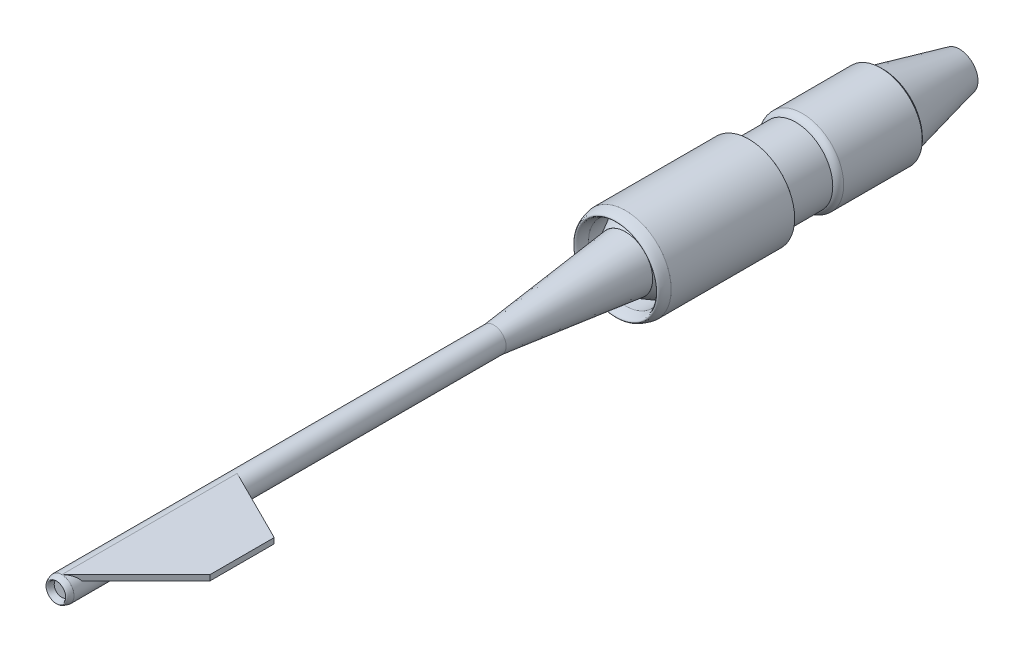
ISO-10303-21;
HEADER;
FILE_DESCRIPTION(('STEP AP214'),'2;1');
FILE_NAME('part.step','',(''),(''),'','','');
FILE_SCHEMA(('AUTOMOTIVE_DESIGN { 1 0 10303 214 1 1 1 1 }'));
ENDSEC;
DATA;
#1=APPLICATION_CONTEXT('core data for automotive mechanical design processes');
#2=APPLICATION_PROTOCOL_DEFINITION('international standard','automotive_design',2000,#1);
#3=PRODUCT_CONTEXT('',#1,'mechanical');
#4=PRODUCT('Part','Part','',(#3));
#5=PRODUCT_RELATED_PRODUCT_CATEGORY('part','',(#4));
#6=PRODUCT_DEFINITION_FORMATION('','',#4);
#7=PRODUCT_DEFINITION_CONTEXT('part definition',#1,'design');
#8=PRODUCT_DEFINITION('design','',#6,#7);
#9=PRODUCT_DEFINITION_SHAPE('','',#8);
#10=(LENGTH_UNIT() NAMED_UNIT(*) SI_UNIT(.MILLI.,.METRE.));
#11=(NAMED_UNIT(*) PLANE_ANGLE_UNIT() SI_UNIT($,.RADIAN.));
#12=(NAMED_UNIT(*) SI_UNIT($,.STERADIAN.) SOLID_ANGLE_UNIT());
#13=UNCERTAINTY_MEASURE_WITH_UNIT(LENGTH_MEASURE(1.E-05),#10,'distance_accuracy_value','');
#14=(GEOMETRIC_REPRESENTATION_CONTEXT(3) GLOBAL_UNCERTAINTY_ASSIGNED_CONTEXT((#13)) GLOBAL_UNIT_ASSIGNED_CONTEXT((#10,
#11,#12)) REPRESENTATION_CONTEXT('',''));
#15=CARTESIAN_POINT('',(0.,0.,0.));
#16=DIRECTION('',(0.,0.,1.));
#17=DIRECTION('',(1.,0.,0.));
#18=AXIS2_PLACEMENT_3D('',#15,#16,#17);
#19=CARTESIAN_POINT('',(1.46957615897682E-13,0.,5137.5));
#20=DIRECTION('',(0.,0.,-1.));
#21=DIRECTION('',(-1.,0.,0.));
#22=AXIS2_PLACEMENT_3D('',#19,#20,#21);
#23=CYLINDRICAL_SURFACE('',#22,112.5);
#24=CARTESIAN_POINT('',(1.46957615897682E-13,0.,1200.));
#25=DIRECTION('',(0.,0.,1.));
#26=DIRECTION('',(1.,0.,0.));
#27=AXIS2_PLACEMENT_3D('',#24,#25,#26);
#28=CIRCLE('',#27,112.5);
#29=CARTESIAN_POINT('',(112.5,0.,1200.));
#30=VERTEX_POINT('',#29);
#31=EDGE_CURVE('E155',#30,#30,#28,.T.);
#32=ORIENTED_EDGE('',*,*,#31,.T.);
#33=EDGE_LOOP('',(#32));
#34=FACE_BOUND('',#33,.T.);
#35=CARTESIAN_POINT('',(1.46957615897682E-13,0.,5139.26892503386));
#36=DIRECTION('',(-0.707106781186547,0.,-0.707106781186548));
#37=DIRECTION('',(0.707106781186548,0.,-0.707106781186547));
#38=AXIS2_PLACEMENT_3D('',#35,#36,#37);
#39=ELLIPSE('',#38,159.099025766973,112.5);
#40=CARTESIAN_POINT('',(1.76892503385748,112.486092047971,5137.5));
#41=VERTEX_POINT('',#40);
#42=CARTESIAN_POINT('',(93.5507258153167,62.4860920479709,5045.71819921854));
#43=VERTEX_POINT('',#42);
#44=EDGE_CURVE('E105',#41,#43,#39,.T.);
#45=ORIENTED_EDGE('',*,*,#44,.F.);
#46=CARTESIAN_POINT('',(1.46957615897682E-13,0.,5137.5));
#47=DIRECTION('',(0.,0.,1.));
#48=DIRECTION('',(1.,0.,0.));
#49=AXIS2_PLACEMENT_3D('',#46,#47,#48);
#50=CIRCLE('',#49,112.5);
#51=EDGE_CURVE('E156',#41,#41,#50,.T.);
#52=ORIENTED_EDGE('',*,*,#51,.F.);
#53=DIRECTION('',(0.,0.,-1.));
#54=VECTOR('',#53,1.);
#55=CARTESIAN_POINT('',(1.76892503385747,112.486092047971,0.));
#56=LINE('',#55,#54);
#57=CARTESIAN_POINT('',(1.76892503385813,112.486092047971,3540.));
#58=VERTEX_POINT('',#57);
#59=EDGE_CURVE('E106',#41,#58,#56,.T.);
#60=ORIENTED_EDGE('',*,*,#59,.T.);
#61=CARTESIAN_POINT('',(1.46957615897682E-13,0.,3539.11553748307));
#62=DIRECTION('',(0.447213595499958,0.,-0.894427190999916));
#63=DIRECTION('',(-0.894427190999916,0.,-0.447213595499958));
#64=AXIS2_PLACEMENT_3D('',#61,#62,#63);
#65=ELLIPSE('',#64,125.778823734363,112.5);
#66=CARTESIAN_POINT('',(93.5507258153164,62.4860920479709,3585.89090039073));
#67=VERTEX_POINT('',#66);
#68=EDGE_CURVE('E12',#58,#67,#65,.T.);
#69=ORIENTED_EDGE('',*,*,#68,.T.);
#70=DIRECTION('',(0.,0.,-1.));
#71=VECTOR('',#70,1.);
#72=CARTESIAN_POINT('',(93.5507258153165,62.4860920479709,5137.5));
#73=LINE('',#72,#71);
#74=EDGE_CURVE('E69',#43,#67,#73,.T.);
#75=ORIENTED_EDGE('',*,*,#74,.F.);
#76=EDGE_LOOP('',(#45,#52,#60,#69,#75));
#77=FACE_BOUND('',#76,.T.);
#78=ADVANCED_FACE('F46',(#34,#77),#23,.T.);
#79=CARTESIAN_POINT('',(0.,0.,0.));
#80=DIRECTION('',(0.,0.,1.));
#81=DIRECTION('',(1.,0.,0.));
#82=AXIS2_PLACEMENT_3D('',#79,#80,#81);
#83=PLANE('',#82);
#84=CARTESIAN_POINT('',(0.,0.,0.));
#85=DIRECTION('',(0.,0.,-1.));
#86=DIRECTION('',(-1.,0.,0.));
#87=AXIS2_PLACEMENT_3D('',#84,#85,#86);
#88=CIRCLE('',#87,247.5);
#89=CARTESIAN_POINT('',(-247.5,0.,0.));
#90=VERTEX_POINT('',#89);
#91=EDGE_CURVE('E54',#90,#90,#88,.T.);
#92=ORIENTED_EDGE('',*,*,#91,.T.);
#93=EDGE_LOOP('',(#92));
#94=FACE_BOUND('',#93,.T.);
#95=ADVANCED_FACE('F48',(#94),#83,.F.);
#96=CARTESIAN_POINT('',(1.46957615897682E-13,0.,1200.));
#97=DIRECTION('',(0.,0.,-1.));
#98=DIRECTION('',(-1.,0.,0.));
#99=AXIS2_PLACEMENT_3D('',#96,#97,#98);
#100=CONICAL_SURFACE('',#99,112.5,0.112028962425988);
#101=ORIENTED_EDGE('',*,*,#91,.F.);
#102=EDGE_LOOP('',(#101));
#103=FACE_BOUND('',#102,.T.);
#104=ORIENTED_EDGE('',*,*,#31,.F.);
#105=EDGE_LOOP('',(#104));
#106=FACE_BOUND('',#105,.T.);
#107=ADVANCED_FACE('F136',(#103,#106),#100,.T.);
#108=CARTESIAN_POINT('',(0.,67.5,5137.5));
#109=CARTESIAN_POINT('',(0.,90.,5237.5));
#110=CARTESIAN_POINT('',(0.,112.5,5137.5));
#111=B_SPLINE_CURVE_WITH_KNOTS('',2,(#108,#109,#110),.UNSPECIFIED.,.F.,.F.,(3,3),(0.,1.),.UNSPECIFIED.);
#112=CARTESIAN_POINT('',(0.,0.,5137.5));
#113=DIRECTION('',(0.,0.,-1.));
#114=AXIS1_PLACEMENT('',#112,#113);
#115=SURFACE_OF_REVOLUTION('',#111,#114);
#116=ORIENTED_EDGE('',*,*,#51,.T.);
#117=EDGE_LOOP('',(#116));
#118=FACE_BOUND('',#117,.T.);
#119=CARTESIAN_POINT('',(0.,0.,5137.5));
#120=DIRECTION('',(0.,0.,-1.));
#121=DIRECTION('',(0.,1.,0.));
#122=AXIS2_PLACEMENT_3D('',#119,#120,#121);
#123=CIRCLE('',#122,67.5);
#124=CARTESIAN_POINT('',(0.,67.5,5137.5));
#125=VERTEX_POINT('',#124);
#126=EDGE_CURVE('E121',#125,#125,#123,.T.);
#127=ORIENTED_EDGE('',*,*,#126,.T.);
#128=EDGE_LOOP('',(#127));
#129=FACE_BOUND('',#128,.T.);
#130=ADVANCED_FACE('F131',(#118,#129),#115,.T.);
#131=CARTESIAN_POINT('',(1.46957615897682E-13,0.,5137.5));
#132=DIRECTION('',(0.,0.,1.));
#133=DIRECTION('',(1.,0.,0.));
#134=AXIS2_PLACEMENT_3D('',#131,#132,#133);
#135=PLANE('',#134);
#136=ORIENTED_EDGE('',*,*,#126,.F.);
#137=EDGE_LOOP('',(#136));
#138=FACE_BOUND('',#137,.T.);
#139=ADVANCED_FACE('F135',(#138),#135,.T.);
#140=CARTESIAN_POINT('',(2569.63446251693,62.4860920479709,2569.63446251693));
#141=DIRECTION('',(-0.707106781186547,0.,-0.707106781186548));
#142=DIRECTION('',(-0.707106781186548,0.,0.707106781186547));
#143=AXIS2_PLACEMENT_3D('',#140,#141,#142);
#144=PLANE('',#143);
#145=DIRECTION('',(-0.707106781186548,0.,0.707106781186547));
#146=VECTOR('',#145,1.);
#147=CARTESIAN_POINT('',(2569.63446251693,112.486092047971,2569.63446251693));
#148=LINE('',#147,#146);
#149=CARTESIAN_POINT('',(676.768925033857,112.486092047971,4462.5));
#150=VERTEX_POINT('',#149);
#151=EDGE_CURVE('E112',#150,#41,#148,.T.);
#152=ORIENTED_EDGE('',*,*,#151,.T.);
#153=ORIENTED_EDGE('',*,*,#44,.T.);
#154=DIRECTION('',(-0.707106781186548,0.,0.707106781186547));
#155=VECTOR('',#154,1.);
#156=CARTESIAN_POINT('',(2569.63446251693,62.4860920479709,2569.63446251693));
#157=LINE('',#156,#155);
#158=CARTESIAN_POINT('',(676.768925033857,62.4860920479709,4462.5));
#159=VERTEX_POINT('',#158);
#160=EDGE_CURVE('E102',#159,#43,#157,.T.);
#161=ORIENTED_EDGE('',*,*,#160,.F.);
#162=DIRECTION('',(0.,1.,0.));
#163=VECTOR('',#162,1.);
#164=CARTESIAN_POINT('',(676.768925033857,62.4860920479709,4462.5));
#165=LINE('',#164,#163);
#166=EDGE_CURVE('E90',#159,#150,#165,.T.);
#167=ORIENTED_EDGE('',*,*,#166,.T.);
#168=EDGE_LOOP('',(#152,#153,#161,#167));
#169=FACE_BOUND('',#168,.T.);
#170=ADVANCED_FACE('F103',(#169),#144,.F.);
#171=CARTESIAN_POINT('',(0.,62.4860920479709,0.));
#172=DIRECTION('',(0.,1.,0.));
#173=DIRECTION('',(0.,0.,1.));
#174=AXIS2_PLACEMENT_3D('',#171,#172,#173);
#175=PLANE('',#174);
#176=ORIENTED_EDGE('',*,*,#160,.T.);
#177=ORIENTED_EDGE('',*,*,#74,.T.);
#178=DIRECTION('',(-0.894427190999916,0.,-0.447213595499958));
#179=VECTOR('',#178,1.);
#180=CARTESIAN_POINT('',(-1415.64621499323,62.4860920479709,2831.29242998646));
#181=LINE('',#180,#179);
#182=CARTESIAN_POINT('',(676.768925033857,62.4860920479709,3877.5));
#183=VERTEX_POINT('',#182);
#184=EDGE_CURVE('E100',#183,#67,#181,.T.);
#185=ORIENTED_EDGE('',*,*,#184,.F.);
#186=DIRECTION('',(0.,0.,-1.));
#187=VECTOR('',#186,1.);
#188=CARTESIAN_POINT('',(676.768925033857,62.4860920479709,0.));
#189=LINE('',#188,#187);
#190=EDGE_CURVE('E94',#159,#183,#189,.T.);
#191=ORIENTED_EDGE('',*,*,#190,.F.);
#192=EDGE_LOOP('',(#176,#177,#185,#191));
#193=FACE_BOUND('',#192,.T.);
#194=ADVANCED_FACE('F108',(#193),#175,.F.);
#195=CARTESIAN_POINT('',(-1415.64621499323,62.4860920479709,2831.29242998646));
#196=DIRECTION('',(0.447213595499958,0.,-0.894427190999916));
#197=DIRECTION('',(-0.894427190999916,0.,-0.447213595499958));
#198=AXIS2_PLACEMENT_3D('',#195,#196,#197);
#199=PLANE('',#198);
#200=ORIENTED_EDGE('',*,*,#68,.F.);
#201=DIRECTION('',(-0.894427190999916,0.,-0.447213595499958));
#202=VECTOR('',#201,1.);
#203=CARTESIAN_POINT('',(-1415.64621499323,112.486092047971,2831.29242998646));
#204=LINE('',#203,#202);
#205=CARTESIAN_POINT('',(676.768925033857,112.486092047971,3877.5));
#206=VERTEX_POINT('',#205);
#207=EDGE_CURVE('E61',#206,#58,#204,.T.);
#208=ORIENTED_EDGE('',*,*,#207,.F.);
#209=DIRECTION('',(0.,1.,0.));
#210=VECTOR('',#209,1.);
#211=CARTESIAN_POINT('',(676.768925033857,62.4860920479709,3877.5));
#212=LINE('',#211,#210);
#213=EDGE_CURVE('E99',#183,#206,#212,.T.);
#214=ORIENTED_EDGE('',*,*,#213,.F.);
#215=ORIENTED_EDGE('',*,*,#184,.T.);
#216=EDGE_LOOP('',(#200,#208,#214,#215));
#217=FACE_BOUND('',#216,.T.);
#218=ADVANCED_FACE('F165',(#217),#199,.T.);
#219=CARTESIAN_POINT('',(676.768925033857,62.4860920479709,0.));
#220=DIRECTION('',(1.,0.,0.));
#221=DIRECTION('',(0.,0.,-1.));
#222=AXIS2_PLACEMENT_3D('',#219,#220,#221);
#223=PLANE('',#222);
#224=DIRECTION('',(0.,0.,-1.));
#225=VECTOR('',#224,1.);
#226=CARTESIAN_POINT('',(676.768925033857,112.486092047971,0.));
#227=LINE('',#226,#225);
#228=EDGE_CURVE('E95',#150,#206,#227,.T.);
#229=ORIENTED_EDGE('',*,*,#228,.F.);
#230=ORIENTED_EDGE('',*,*,#166,.F.);
#231=ORIENTED_EDGE('',*,*,#190,.T.);
#232=ORIENTED_EDGE('',*,*,#213,.T.);
#233=EDGE_LOOP('',(#229,#230,#231,#232));
#234=FACE_BOUND('',#233,.T.);
#235=ADVANCED_FACE('F92',(#234),#223,.T.);
#236=CARTESIAN_POINT('',(0.,112.486092047971,0.));
#237=DIRECTION('',(0.,1.,0.));
#238=DIRECTION('',(0.,0.,1.));
#239=AXIS2_PLACEMENT_3D('',#236,#237,#238);
#240=PLANE('',#239);
#241=ORIENTED_EDGE('',*,*,#151,.F.);
#242=ORIENTED_EDGE('',*,*,#228,.T.);
#243=ORIENTED_EDGE('',*,*,#207,.T.);
#244=ORIENTED_EDGE('',*,*,#59,.F.);
#245=EDGE_LOOP('',(#241,#242,#243,#244));
#246=FACE_BOUND('',#245,.T.);
#247=ADVANCED_FACE('F166',(#246),#240,.T.);
#248=CLOSED_SHELL('',(#78,#95,#107,#130,#139,#170,#194,#218,#235,#247));
#249=MANIFOLD_SOLID_BREP('B2',#248);
#250=CARTESIAN_POINT('',(0.,0.,-1125.));
#251=DIRECTION('',(0.,0.,1.));
#252=DIRECTION('',(1.,0.,0.));
#253=AXIS2_PLACEMENT_3D('',#250,#251,#252);
#254=CYLINDRICAL_SURFACE('',#253,337.5);
#255=CARTESIAN_POINT('',(0.,0.,-306.632414300902));
#256=DIRECTION('',(0.,0.,1.));
#257=DIRECTION('',(1.,0.,0.));
#258=AXIS2_PLACEMENT_3D('',#255,#256,#257);
#259=CIRCLE('',#258,337.5);
#260=CARTESIAN_POINT('',(337.5,0.,-306.632414300902));
#261=VERTEX_POINT('',#260);
#262=EDGE_CURVE('E246',#261,#261,#259,.F.);
#263=ORIENTED_EDGE('',*,*,#262,.F.);
#264=EDGE_LOOP('',(#263));
#265=FACE_BOUND('',#264,.T.);
#266=CARTESIAN_POINT('',(0.,0.,-1125.));
#267=DIRECTION('',(0.,0.,-1.));
#268=DIRECTION('',(-1.,0.,0.));
#269=AXIS2_PLACEMENT_3D('',#266,#267,#268);
#270=CIRCLE('',#269,337.5);
#271=CARTESIAN_POINT('',(-337.5,0.,-1125.));
#272=VERTEX_POINT('',#271);
#273=EDGE_CURVE('E242',#272,#272,#270,.F.);
#274=ORIENTED_EDGE('',*,*,#273,.F.);
#275=EDGE_LOOP('',(#274));
#276=FACE_BOUND('',#275,.T.);
#277=ADVANCED_FACE('F235',(#265,#276),#254,.F.);
#278=CARTESIAN_POINT('',(0.,0.,0.));
#279=DIRECTION('',(0.,0.,1.));
#280=DIRECTION('',(1.,0.,0.));
#281=AXIS2_PLACEMENT_3D('',#278,#279,#280);
#282=CIRCLE('',#281,337.5);
#283=CARTESIAN_POINT('',(337.5,0.,0.));
#284=VERTEX_POINT('',#283);
#285=EDGE_CURVE('E258',#284,#284,#282,.T.);
#286=ORIENTED_EDGE('',*,*,#285,.T.);
#287=EDGE_LOOP('',(#286));
#288=FACE_BOUND('',#287,.T.);
#289=CARTESIAN_POINT('',(0.,0.,-163.537287627148));
#290=DIRECTION('',(0.,0.,-1.));
#291=DIRECTION('',(-1.,0.,0.));
#292=AXIS2_PLACEMENT_3D('',#289,#290,#291);
#293=CIRCLE('',#292,337.5);
#294=CARTESIAN_POINT('',(-337.5,0.,-163.537287627148));
#295=VERTEX_POINT('',#294);
#296=EDGE_CURVE('E250',#295,#295,#293,.F.);
#297=ORIENTED_EDGE('',*,*,#296,.F.);
#298=EDGE_LOOP('',(#297));
#299=FACE_BOUND('',#298,.T.);
#300=ADVANCED_FACE('F279',(#288,#299),#254,.F.);
#301=CARTESIAN_POINT('',(0.,0.,-1125.));
#302=DIRECTION('',(0.,0.,1.));
#303=DIRECTION('',(1.,0.,0.));
#304=AXIS2_PLACEMENT_3D('',#301,#302,#303);
#305=CYLINDRICAL_SURFACE('',#304,416.25);
#306=CARTESIAN_POINT('',(0.,0.,-1125.));
#307=DIRECTION('',(0.,0.,1.));
#308=DIRECTION('',(1.,0.,0.));
#309=AXIS2_PLACEMENT_3D('',#306,#307,#308);
#310=CIRCLE('',#309,416.25);
#311=CARTESIAN_POINT('',(416.25,0.,-1125.));
#312=VERTEX_POINT('',#311);
#313=EDGE_CURVE('E313',#312,#312,#310,.T.);
#314=ORIENTED_EDGE('',*,*,#313,.T.);
#315=EDGE_LOOP('',(#314));
#316=FACE_BOUND('',#315,.T.);
#317=CARTESIAN_POINT('',(0.,0.,0.));
#318=DIRECTION('',(0.,0.,1.));
#319=DIRECTION('',(1.,0.,0.));
#320=AXIS2_PLACEMENT_3D('',#317,#318,#319);
#321=CIRCLE('',#320,416.25);
#322=CARTESIAN_POINT('',(416.25,0.,0.));
#323=VERTEX_POINT('',#322);
#324=EDGE_CURVE('E255',#323,#323,#321,.T.);
#325=ORIENTED_EDGE('',*,*,#324,.F.);
#326=EDGE_LOOP('',(#325));
#327=FACE_BOUND('',#326,.T.);
#328=ADVANCED_FACE('F237',(#316,#327),#305,.T.);
#329=CARTESIAN_POINT('',(0.,416.25,0.));
#330=CARTESIAN_POINT('',(0.,376.875,180.));
#331=CARTESIAN_POINT('',(0.,337.5,0.));
#332=B_SPLINE_CURVE_WITH_KNOTS('',2,(#329,#330,#331),.UNSPECIFIED.,.F.,.F.,(3,3),(0.,1.),.UNSPECIFIED.);
#333=CARTESIAN_POINT('',(0.,0.,0.));
#334=DIRECTION('',(0.,0.,1.));
#335=AXIS1_PLACEMENT('',#333,#334);
#336=SURFACE_OF_REVOLUTION('',#332,#335);
#337=ORIENTED_EDGE('',*,*,#285,.F.);
#338=EDGE_LOOP('',(#337));
#339=FACE_BOUND('',#338,.T.);
#340=ORIENTED_EDGE('',*,*,#324,.T.);
#341=EDGE_LOOP('',(#340));
#342=FACE_BOUND('',#341,.T.);
#343=ADVANCED_FACE('F271',(#339,#342),#336,.T.);
#344=CARTESIAN_POINT('',(0.,247.5,-306.632414300902));
#345=DIRECTION('',(0.,0.,1.));
#346=DIRECTION('',(1.,0.,0.));
#347=AXIS2_PLACEMENT_3D('',#344,#345,#346);
#348=PLANE('',#347);
#349=CARTESIAN_POINT('',(0.,0.,-306.632414300902));
#350=DIRECTION('',(0.,0.,1.));
#351=DIRECTION('',(1.,0.,0.));
#352=AXIS2_PLACEMENT_3D('',#349,#350,#351);
#353=CIRCLE('',#352,247.5);
#354=CARTESIAN_POINT('',(247.5,0.,-306.632414300902));
#355=VERTEX_POINT('',#354);
#356=EDGE_CURVE('E261',#355,#355,#353,.T.);
#357=ORIENTED_EDGE('',*,*,#356,.T.);
#358=EDGE_LOOP('',(#357));
#359=FACE_BOUND('',#358,.T.);
#360=ORIENTED_EDGE('',*,*,#262,.T.);
#361=EDGE_LOOP('',(#360));
#362=FACE_BOUND('',#361,.T.);
#363=ADVANCED_FACE('F274',(#359,#362),#348,.F.);
#364=CARTESIAN_POINT('',(0.,0.,-306.632414300902));
#365=DIRECTION('',(0.,0.,-1.));
#366=DIRECTION('',(-1.,0.,0.));
#367=AXIS2_PLACEMENT_3D('',#364,#365,#366);
#368=CONICAL_SURFACE('',#367,416.25,0.503098996215438);
#369=CARTESIAN_POINT('',(0.,0.,0.));
#370=DIRECTION('',(0.,0.,1.));
#371=DIRECTION('',(1.,0.,0.));
#372=AXIS2_PLACEMENT_3D('',#369,#370,#371);
#373=CIRCLE('',#372,247.5);
#374=CARTESIAN_POINT('',(247.5,0.,0.));
#375=VERTEX_POINT('',#374);
#376=EDGE_CURVE('E318',#375,#375,#373,.T.);
#377=ORIENTED_EDGE('',*,*,#376,.F.);
#378=EDGE_LOOP('',(#377));
#379=FACE_BOUND('',#378,.T.);
#380=ORIENTED_EDGE('',*,*,#296,.T.);
#381=EDGE_LOOP('',(#380));
#382=FACE_BOUND('',#381,.T.);
#383=ADVANCED_FACE('F289',(#379,#382),#368,.T.);
#384=CARTESIAN_POINT('',(0.,0.,0.));
#385=DIRECTION('',(0.,0.,1.));
#386=DIRECTION('',(1.,0.,0.));
#387=AXIS2_PLACEMENT_3D('',#384,#385,#386);
#388=CYLINDRICAL_SURFACE('',#387,247.5);
#389=ORIENTED_EDGE('',*,*,#356,.F.);
#390=EDGE_LOOP('',(#389));
#391=FACE_BOUND('',#390,.T.);
#392=ORIENTED_EDGE('',*,*,#376,.T.);
#393=EDGE_LOOP('',(#392));
#394=FACE_BOUND('',#393,.T.);
#395=ADVANCED_FACE('F276',(#391,#394),#388,.F.);
#396=CARTESIAN_POINT('',(0.,337.5,-1155.));
#397=CARTESIAN_POINT('',(0.,382.589285714286,-1155.));
#398=CARTESIAN_POINT('',(0.,416.25,-1125.));
#399=(BOUNDED_CURVE() B_SPLINE_CURVE(2,(#396,#397,#398),.UNSPECIFIED.,.F.,
.F.) B_SPLINE_CURVE_WITH_KNOTS((3,3),(0.,1.),
.UNSPECIFIED.) CURVE() GEOMETRIC_REPRESENTATION_ITEM() RATIONAL_B_SPLINE_CURVE((1.,
0.806097205553273,1.)) REPRESENTATION_ITEM(''));
#400=CARTESIAN_POINT('',(0.,0.,-1125.));
#401=DIRECTION('',(0.,0.,1.));
#402=AXIS1_PLACEMENT('',#400,#401);
#403=SURFACE_OF_REVOLUTION('',#399,#402);
#404=ORIENTED_EDGE('',*,*,#313,.F.);
#405=EDGE_LOOP('',(#404));
#406=FACE_BOUND('',#405,.T.);
#407=CARTESIAN_POINT('',(0.,0.,-1155.));
#408=DIRECTION('',(0.,0.,1.));
#409=DIRECTION('',(1.,0.,0.));
#410=AXIS2_PLACEMENT_3D('',#407,#408,#409);
#411=CIRCLE('',#410,337.5);
#412=CARTESIAN_POINT('',(337.5,0.,-1155.));
#413=VERTEX_POINT('',#412);
#414=EDGE_CURVE('E311',#413,#413,#411,.F.);
#415=ORIENTED_EDGE('',*,*,#414,.F.);
#416=EDGE_LOOP('',(#415));
#417=FACE_BOUND('',#416,.T.);
#418=ADVANCED_FACE('F298',(#406,#417),#403,.T.);
#419=CARTESIAN_POINT('',(0.,0.,-1614.96422928336));
#420=DIRECTION('',(0.,0.,-1.));
#421=DIRECTION('',(-1.,0.,0.));
#422=AXIS2_PLACEMENT_3D('',#419,#420,#421);
#423=TOROIDAL_SURFACE('',#422,305.432483949171,71.5524158465949);
#424=CARTESIAN_POINT('',(0.,0.,-1611.));
#425=DIRECTION('',(0.,0.,-1.));
#426=DIRECTION('',(-1.,0.,0.));
#427=AXIS2_PLACEMENT_3D('',#424,#425,#426);
#428=CIRCLE('',#427,376.875);
#429=CARTESIAN_POINT('',(376.875,0.,-1611.));
#430=VERTEX_POINT('',#429);
#431=EDGE_CURVE('E459',#430,#430,#428,.T.);
#432=ORIENTED_EDGE('',*,*,#431,.F.);
#433=EDGE_LOOP('',(#432));
#434=FACE_BOUND('',#433,.T.);
#435=CARTESIAN_POINT('',(0.,0.,-1551.));
#436=DIRECTION('',(0.,0.,-1.));
#437=DIRECTION('',(-1.,0.,0.));
#438=AXIS2_PLACEMENT_3D('',#435,#436,#437);
#439=CIRCLE('',#438,337.5);
#440=CARTESIAN_POINT('',(-337.5,0.,-1551.));
#441=VERTEX_POINT('',#440);
#442=EDGE_CURVE('E448',#441,#441,#439,.T.);
#443=ORIENTED_EDGE('',*,*,#442,.T.);
#444=EDGE_LOOP('',(#443));
#445=FACE_BOUND('',#444,.T.);
#446=ADVANCED_FACE('F302',(#434,#445),#423,.T.);
#447=CARTESIAN_POINT('',(0.,0.,-2327.));
#448=DIRECTION('',(0.,0.,1.));
#449=DIRECTION('',(1.,0.,0.));
#450=AXIS2_PLACEMENT_3D('',#447,#448,#449);
#451=CYLINDRICAL_SURFACE('',#450,376.875);
#452=CARTESIAN_POINT('',(0.,0.,-2327.));
#453=DIRECTION('',(0.,0.,-1.));
#454=DIRECTION('',(-1.,0.,0.));
#455=AXIS2_PLACEMENT_3D('',#452,#453,#454);
#456=CIRCLE('',#455,376.875);
#457=CARTESIAN_POINT('',(376.875,0.,-2327.));
#458=VERTEX_POINT('',#457);
#459=EDGE_CURVE('E450',#458,#458,#456,.T.);
#460=CARTESIAN_POINT('',(376.875,0.,-2327.));
#461=CARTESIAN_POINT('',(376.875,0.,-2319.54166666667));
#462=CARTESIAN_POINT('',(376.875,0.,-2312.08333333333));
#463=CARTESIAN_POINT('',(376.875,0.,-2297.16666666667));
#464=CARTESIAN_POINT('',(376.875,0.,-2289.70833333333));
#465=CARTESIAN_POINT('',(376.875,0.,-2274.79166666667));
#466=CARTESIAN_POINT('',(376.875,0.,-2267.33333333333));
#467=CARTESIAN_POINT('',(376.875,0.,-2252.41666666667));
#468=CARTESIAN_POINT('',(376.875,0.,-2244.95833333333));
#469=CARTESIAN_POINT('',(376.875,0.,-2230.04166666667));
#470=CARTESIAN_POINT('',(376.875,0.,-2222.58333333333));
#471=CARTESIAN_POINT('',(376.875,0.,-2207.66666666667));
#472=CARTESIAN_POINT('',(376.875,0.,-2200.20833333333));
#473=CARTESIAN_POINT('',(376.875,0.,-2185.29166666667));
#474=CARTESIAN_POINT('',(376.875,0.,-2177.83333333333));
#475=CARTESIAN_POINT('',(376.875,0.,-2162.91666666667));
#476=CARTESIAN_POINT('',(376.875,0.,-2155.45833333333));
#477=CARTESIAN_POINT('',(376.875,0.,-2140.54166666667));
#478=CARTESIAN_POINT('',(376.875,0.,-2133.08333333333));
#479=CARTESIAN_POINT('',(376.875,0.,-2118.16666666667));
#480=CARTESIAN_POINT('',(376.875,0.,-2110.70833333333));
#481=CARTESIAN_POINT('',(376.875,0.,-2095.79166666667));
#482=CARTESIAN_POINT('',(376.875,0.,-2088.33333333333));
#483=CARTESIAN_POINT('',(376.875,0.,-2073.41666666667));
#484=CARTESIAN_POINT('',(376.875,0.,-2065.95833333333));
#485=CARTESIAN_POINT('',(376.875,0.,-2051.04166666667));
#486=CARTESIAN_POINT('',(376.875,0.,-2043.58333333333));
#487=CARTESIAN_POINT('',(376.875,0.,-2028.66666666667));
#488=CARTESIAN_POINT('',(376.875,0.,-2021.20833333333));
#489=CARTESIAN_POINT('',(376.875,0.,-2006.29166666667));
#490=CARTESIAN_POINT('',(376.875,0.,-1998.83333333333));
#491=CARTESIAN_POINT('',(376.875,0.,-1983.91666666667));
#492=CARTESIAN_POINT('',(376.875,0.,-1976.45833333333));
#493=CARTESIAN_POINT('',(376.875,0.,-1961.54166666667));
#494=CARTESIAN_POINT('',(376.875,0.,-1954.08333333333));
#495=CARTESIAN_POINT('',(376.875,0.,-1939.16666666667));
#496=CARTESIAN_POINT('',(376.875,0.,-1931.70833333333));
#497=CARTESIAN_POINT('',(376.875,0.,-1916.79166666667));
#498=CARTESIAN_POINT('',(376.875,0.,-1909.33333333333));
#499=CARTESIAN_POINT('',(376.875,0.,-1894.41666666667));
#500=CARTESIAN_POINT('',(376.875,0.,-1886.95833333333));
#501=CARTESIAN_POINT('',(376.875,0.,-1872.04166666667));
#502=CARTESIAN_POINT('',(376.875,0.,-1864.58333333333));
#503=CARTESIAN_POINT('',(376.875,0.,-1849.66666666667));
#504=CARTESIAN_POINT('',(376.875,0.,-1842.20833333333));
#505=CARTESIAN_POINT('',(376.875,0.,-1827.29166666667));
#506=CARTESIAN_POINT('',(376.875,0.,-1819.83333333333));
#507=CARTESIAN_POINT('',(376.875,0.,-1804.91666666667));
#508=CARTESIAN_POINT('',(376.875,0.,-1797.45833333333));
#509=CARTESIAN_POINT('',(376.875,0.,-1782.54166666667));
#510=CARTESIAN_POINT('',(376.875,0.,-1775.08333333333));
#511=CARTESIAN_POINT('',(376.875,0.,-1760.16666666667));
#512=CARTESIAN_POINT('',(376.875,0.,-1752.70833333333));
#513=CARTESIAN_POINT('',(376.875,0.,-1737.79166666667));
#514=CARTESIAN_POINT('',(376.875,0.,-1730.33333333333));
#515=CARTESIAN_POINT('',(376.875,0.,-1715.41666666667));
#516=CARTESIAN_POINT('',(376.875,0.,-1707.95833333333));
#517=CARTESIAN_POINT('',(376.875,0.,-1693.04166666667));
#518=CARTESIAN_POINT('',(376.875,0.,-1685.58333333333));
#519=CARTESIAN_POINT('',(376.875,0.,-1670.66666666667));
#520=CARTESIAN_POINT('',(376.875,0.,-1663.20833333333));
#521=CARTESIAN_POINT('',(376.875,0.,-1648.29166666667));
#522=CARTESIAN_POINT('',(376.875,0.,-1640.83333333333));
#523=CARTESIAN_POINT('',(376.875,0.,-1625.91666666667));
#524=CARTESIAN_POINT('',(376.875,0.,-1618.45833333333));
#525=CARTESIAN_POINT('',(376.875,0.,-1611.));
#526=B_SPLINE_CURVE_WITH_KNOTS('',3,(#460,#461,#462,#463,#464,#465,#466,#467,#468,#469,#470,
#471,#472,#473,#474,#475,#476,#477,#478,#479,#480,#481,#482,#483,#484,#485,#486,#487,#488,#489,
#490,#491,#492,#493,#494,#495,#496,#497,#498,#499,#500,#501,#502,#503,#504,#505,#506,#507,#508,
#509,#510,#511,#512,#513,#514,#515,#516,#517,#518,#519,#520,#521,#522,#523,#524,#525),
.UNSPECIFIED.,.F.,.F.,(4,2,2,2,2,2,2,2,2,2,2,2,2,2,2,2,2,2,2,2,2,2,2,2,2,2,2,2,2,2,2,2,4),(0.,
22.3750000000003,44.7500000000001,67.1250000000003,89.5000000000001,111.875,134.25,156.625,179.,
201.375,223.75,246.125,268.5,290.875,313.25,335.625,358.,380.375,402.75,425.125,447.5,469.875,
492.25,514.625,537.,559.375,581.75,604.125,626.5,648.875,671.25,693.625,716.),.UNSPECIFIED.);
#527=EDGE_CURVE('BSEAM340',#458,#430,#526,.T.);
#528=ORIENTED_EDGE('',*,*,#459,.F.);
#529=ORIENTED_EDGE('',*,*,#431,.T.);
#530=ORIENTED_EDGE('',*,*,#527,.T.);
#531=ORIENTED_EDGE('',*,*,#527,.F.);
#532=EDGE_LOOP('',(#528,#530,#529,#531));
#533=FACE_BOUND('',#532,.T.);
#534=ADVANCED_FACE('F340',(#533),#451,.T.);
#535=CARTESIAN_POINT('',(0.,0.,-1611.));
#536=DIRECTION('',(0.,0.,1.));
#537=DIRECTION('',(1.,0.,0.));
#538=AXIS2_PLACEMENT_3D('',#535,#536,#537);
#539=CYLINDRICAL_SURFACE('',#538,337.5);
#540=ORIENTED_EDGE('',*,*,#442,.F.);
#541=EDGE_LOOP('',(#540));
#542=FACE_BOUND('',#541,.T.);
#543=ORIENTED_EDGE('',*,*,#414,.T.);
#544=EDGE_LOOP('',(#543));
#545=FACE_BOUND('',#544,.T.);
#546=ADVANCED_FACE('F304',(#542,#545),#539,.T.);
#547=CARTESIAN_POINT('',(0.,0.,-1125.));
#548=DIRECTION('',(0.,0.,-1.));
#549=DIRECTION('',(-1.,0.,0.));
#550=AXIS2_PLACEMENT_3D('',#547,#548,#549);
#551=PLANE('',#550);
#552=ORIENTED_EDGE('',*,*,#273,.T.);
#553=EDGE_LOOP('',(#552));
#554=FACE_BOUND('',#553,.T.);
#555=ADVANCED_FACE('F356',(#554),#551,.F.);
#556=CARTESIAN_POINT('',(0.,330.618023233874,-2356.19997253065));
#557=CARTESIAN_POINT('',(0.,357.1875,-2356.19997253065));
#558=CARTESIAN_POINT('',(0.,376.875,-2327.));
#559=(BOUNDED_CURVE() B_SPLINE_CURVE(2,(#556,#557,#558),.UNSPECIFIED.,.F.,
.F.) B_SPLINE_CURVE_WITH_KNOTS((3,3),(0.,1.),
.UNSPECIFIED.) CURVE() GEOMETRIC_REPRESENTATION_ITEM() RATIONAL_B_SPLINE_CURVE((1.,
0.829833158093808,1.)) REPRESENTATION_ITEM(''));
#560=CARTESIAN_POINT('',(0.,0.,-2327.));
#561=DIRECTION('',(0.,0.,1.));
#562=AXIS1_PLACEMENT('',#560,#561);
#563=SURFACE_OF_REVOLUTION('',#559,#562);
#564=ORIENTED_EDGE('',*,*,#459,.T.);
#565=EDGE_LOOP('',(#564));
#566=FACE_BOUND('',#565,.T.);
#567=CARTESIAN_POINT('',(0.,0.,-2356.19997253065));
#568=DIRECTION('',(0.,0.,1.));
#569=DIRECTION('',(1.,0.,0.));
#570=AXIS2_PLACEMENT_3D('',#567,#568,#569);
#571=CIRCLE('',#570,330.618023233874);
#572=CARTESIAN_POINT('',(330.618023233874,0.,-2356.19997253065));
#573=VERTEX_POINT('',#572);
#574=EDGE_CURVE('E45',#573,#573,#571,.T.);
#575=ORIENTED_EDGE('',*,*,#574,.T.);
#576=EDGE_LOOP('',(#575));
#577=FACE_BOUND('',#576,.T.);
#578=ADVANCED_FACE('F363',(#566,#577),#563,.T.);
#579=CARTESIAN_POINT('',(0.,0.,-3043.));
#580=DIRECTION('',(0.,0.,1.));
#581=DIRECTION('',(1.,0.,0.));
#582=AXIS2_PLACEMENT_3D('',#579,#580,#581);
#583=PLANE('',#582);
#584=CARTESIAN_POINT('',(0.,0.,-3043.));
#585=DIRECTION('',(0.,0.,1.));
#586=DIRECTION('',(1.,0.,0.));
#587=AXIS2_PLACEMENT_3D('',#584,#585,#586);
#588=CIRCLE('',#587,168.75);
#589=CARTESIAN_POINT('',(168.75,0.,-3043.));
#590=VERTEX_POINT('',#589);
#591=EDGE_CURVE('E454',#590,#590,#588,.T.);
#592=ORIENTED_EDGE('',*,*,#591,.F.);
#593=EDGE_LOOP('',(#592));
#594=FACE_BOUND('',#593,.T.);
#595=ADVANCED_FACE('F369',(#594),#583,.F.);
#596=CARTESIAN_POINT('',(0.,0.,-3043.));
#597=DIRECTION('',(0.,0.,1.));
#598=DIRECTION('',(1.,0.,0.));
#599=AXIS2_PLACEMENT_3D('',#596,#597,#598);
#600=CONICAL_SURFACE('',#599,168.75,0.231460403304214);
#601=ORIENTED_EDGE('',*,*,#591,.T.);
#602=EDGE_LOOP('',(#601));
#603=FACE_BOUND('',#602,.T.);
#604=ORIENTED_EDGE('',*,*,#574,.F.);
#605=EDGE_LOOP('',(#604));
#606=FACE_BOUND('',#605,.T.);
#607=ADVANCED_FACE('F377',(#603,#606),#600,.T.);
#608=CLOSED_SHELL('',(#277,#300,#328,#343,#363,#383,#395,#418,#446,#534,#546,#555,#578,#595,#607));
#609=MANIFOLD_SOLID_BREP('B6',#608);
#610=ADVANCED_BREP_SHAPE_REPRESENTATION('',(#18,#249,#609),#14);
#611=SHAPE_DEFINITION_REPRESENTATION(#9,#610);
ENDSEC;
END-ISO-10303-21;
